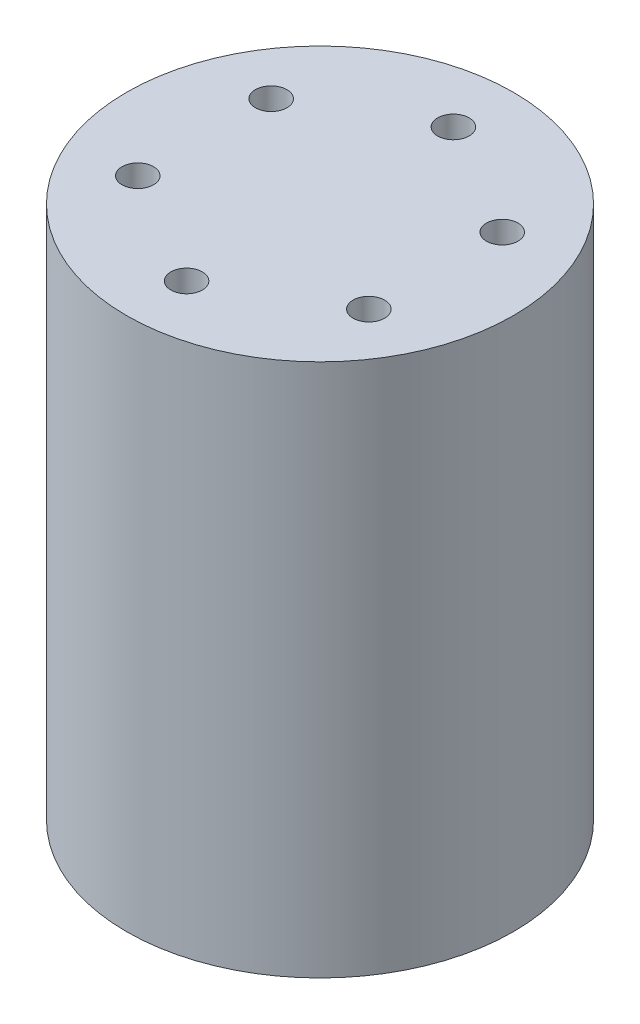
ISO-10303-21;
HEADER;
FILE_DESCRIPTION(('STEP AP214'),'2;1');
FILE_NAME('part.step','',(''),(''),'','','');
FILE_SCHEMA(('AUTOMOTIVE_DESIGN { 1 0 10303 214 1 1 1 1 }'));
ENDSEC;
DATA;
#1=APPLICATION_CONTEXT('core data for automotive mechanical design processes');
#2=APPLICATION_PROTOCOL_DEFINITION('international standard','automotive_design',2000,#1);
#3=PRODUCT_CONTEXT('',#1,'mechanical');
#4=PRODUCT('Part','Part','',(#3));
#5=PRODUCT_RELATED_PRODUCT_CATEGORY('part','',(#4));
#6=PRODUCT_DEFINITION_FORMATION('','',#4);
#7=PRODUCT_DEFINITION_CONTEXT('part definition',#1,'design');
#8=PRODUCT_DEFINITION('design','',#6,#7);
#9=PRODUCT_DEFINITION_SHAPE('','',#8);
#10=(LENGTH_UNIT() NAMED_UNIT(*) SI_UNIT(.MILLI.,.METRE.));
#11=(NAMED_UNIT(*) PLANE_ANGLE_UNIT() SI_UNIT($,.RADIAN.));
#12=(NAMED_UNIT(*) SI_UNIT($,.STERADIAN.) SOLID_ANGLE_UNIT());
#13=UNCERTAINTY_MEASURE_WITH_UNIT(LENGTH_MEASURE(1.E-05),#10,'distance_accuracy_value','');
#14=(GEOMETRIC_REPRESENTATION_CONTEXT(3) GLOBAL_UNCERTAINTY_ASSIGNED_CONTEXT((#13)) GLOBAL_UNIT_ASSIGNED_CONTEXT((#10,
#11,#12)) REPRESENTATION_CONTEXT('',''));
#15=CARTESIAN_POINT('',(0.,0.,0.));
#16=DIRECTION('',(0.,0.,1.));
#17=DIRECTION('',(1.,0.,0.));
#18=AXIS2_PLACEMENT_3D('',#15,#16,#17);
#19=CARTESIAN_POINT('',(0.,25.4,0.));
#20=DIRECTION('',(0.,-1.,0.));
#21=DIRECTION('',(0.,0.,-1.));
#22=AXIS2_PLACEMENT_3D('',#19,#20,#21);
#23=CYLINDRICAL_SURFACE('',#22,18.415);
#24=CARTESIAN_POINT('',(0.,25.4,0.));
#25=DIRECTION('',(0.,1.,0.));
#26=DIRECTION('',(0.,0.,1.));
#27=AXIS2_PLACEMENT_3D('',#24,#25,#26);
#28=CIRCLE('',#27,18.415);
#29=CARTESIAN_POINT('',(0.,25.4,18.415));
#30=VERTEX_POINT('',#29);
#31=EDGE_CURVE('E11',#30,#30,#28,.T.);
#32=ORIENTED_EDGE('',*,*,#31,.F.);
#33=EDGE_LOOP('',(#32));
#34=FACE_BOUND('',#33,.T.);
#35=CARTESIAN_POINT('',(0.,-25.4,0.));
#36=DIRECTION('',(0.,1.,0.));
#37=DIRECTION('',(0.,0.,1.));
#38=AXIS2_PLACEMENT_3D('',#35,#36,#37);
#39=CIRCLE('',#38,18.415);
#40=CARTESIAN_POINT('',(0.,-25.4,18.415));
#41=VERTEX_POINT('',#40);
#42=EDGE_CURVE('E37',#41,#41,#39,.T.);
#43=ORIENTED_EDGE('',*,*,#42,.T.);
#44=EDGE_LOOP('',(#43));
#45=FACE_BOUND('',#44,.T.);
#46=ADVANCED_FACE('F34',(#34,#45),#23,.T.);
#47=CARTESIAN_POINT('',(0.,25.4,0.));
#48=DIRECTION('',(0.,1.,0.));
#49=DIRECTION('',(0.,0.,1.));
#50=AXIS2_PLACEMENT_3D('',#47,#48,#49);
#51=PLANE('',#50);
#52=CARTESIAN_POINT('',(10.9985226280623,25.4,-6.35000000000013));
#53=DIRECTION('',(0.,1.,0.));
#54=DIRECTION('',(-0.866025403784433,0.,0.50000000000001));
#55=AXIS2_PLACEMENT_3D('',#52,#53,#54);
#56=CIRCLE('',#55,1.5);
#57=CARTESIAN_POINT('',(9.69948452238565,25.4,-5.60000000000011));
#58=VERTEX_POINT('',#57);
#59=EDGE_CURVE('E58',#58,#58,#56,.T.);
#60=ORIENTED_EDGE('',*,*,#59,.F.);
#61=EDGE_LOOP('',(#60));
#62=FACE_BOUND('',#61,.T.);
#63=CARTESIAN_POINT('',(10.9985226280624,25.4,6.3499999999999));
#64=DIRECTION('',(0.,1.,0.));
#65=DIRECTION('',(-0.866025403784443,0.,-0.499999999999992));
#66=AXIS2_PLACEMENT_3D('',#63,#64,#65);
#67=CIRCLE('',#66,1.5);
#68=CARTESIAN_POINT('',(9.69948452238576,25.4,5.59999999999991));
#69=VERTEX_POINT('',#68);
#70=EDGE_CURVE('E64',#69,#69,#67,.T.);
#71=ORIENTED_EDGE('',*,*,#70,.F.);
#72=EDGE_LOOP('',(#71));
#73=FACE_BOUND('',#72,.T.);
#74=CARTESIAN_POINT('',(0.,25.4,12.7));
#75=DIRECTION('',(0.,1.,0.));
#76=DIRECTION('',(0.,0.,-1.));
#77=AXIS2_PLACEMENT_3D('',#74,#75,#76);
#78=CIRCLE('',#77,1.5);
#79=CARTESIAN_POINT('',(0.,25.4,11.2));
#80=VERTEX_POINT('',#79);
#81=EDGE_CURVE('E70',#80,#80,#78,.T.);
#82=ORIENTED_EDGE('',*,*,#81,.F.);
#83=EDGE_LOOP('',(#82));
#84=FACE_BOUND('',#83,.T.);
#85=CARTESIAN_POINT('',(-10.9985226280623,25.4,6.35000000000005));
#86=DIRECTION('',(0.,1.,0.));
#87=DIRECTION('',(0.866025403784436,0.,-0.500000000000004));
#88=AXIS2_PLACEMENT_3D('',#85,#86,#87);
#89=CIRCLE('',#88,1.5);
#90=CARTESIAN_POINT('',(-9.69948452238569,25.4,5.60000000000005));
#91=VERTEX_POINT('',#90);
#92=EDGE_CURVE('E76',#91,#91,#89,.T.);
#93=ORIENTED_EDGE('',*,*,#92,.F.);
#94=EDGE_LOOP('',(#93));
#95=FACE_BOUND('',#94,.T.);
#96=CARTESIAN_POINT('',(-10.9985226280624,25.4,-6.34999999999997));
#97=DIRECTION('',(0.,1.,0.));
#98=DIRECTION('',(0.86602540378444,0.,0.499999999999998));
#99=AXIS2_PLACEMENT_3D('',#96,#97,#98);
#100=CIRCLE('',#99,1.5);
#101=CARTESIAN_POINT('',(-9.69948452238573,25.4,-5.59999999999998));
#102=VERTEX_POINT('',#101);
#103=EDGE_CURVE('E52',#102,#102,#100,.T.);
#104=ORIENTED_EDGE('',*,*,#103,.F.);
#105=EDGE_LOOP('',(#104));
#106=FACE_BOUND('',#105,.T.);
#107=CARTESIAN_POINT('',(0.,25.4,-12.7));
#108=DIRECTION('',(0.,1.,0.));
#109=DIRECTION('',(0.,0.,1.));
#110=AXIS2_PLACEMENT_3D('',#107,#108,#109);
#111=CIRCLE('',#110,1.5);
#112=CARTESIAN_POINT('',(0.,25.4,-11.2));
#113=VERTEX_POINT('',#112);
#114=EDGE_CURVE('E46',#113,#113,#111,.T.);
#115=ORIENTED_EDGE('',*,*,#114,.F.);
#116=EDGE_LOOP('',(#115));
#117=FACE_BOUND('',#116,.T.);
#118=ORIENTED_EDGE('',*,*,#31,.T.);
#119=EDGE_LOOP('',(#118));
#120=FACE_BOUND('',#119,.T.);
#121=ADVANCED_FACE('F91',(#62,#73,#84,#95,#106,#117,#120),#51,.T.);
#122=CARTESIAN_POINT('',(0.,-25.4,0.));
#123=DIRECTION('',(0.,1.,0.));
#124=DIRECTION('',(0.,0.,1.));
#125=AXIS2_PLACEMENT_3D('',#122,#123,#124);
#126=PLANE('',#125);
#127=ORIENTED_EDGE('',*,*,#42,.F.);
#128=EDGE_LOOP('',(#127));
#129=FACE_BOUND('',#128,.T.);
#130=ADVANCED_FACE('F94',(#129),#126,.F.);
#131=CARTESIAN_POINT('',(0.,12.7,-12.7));
#132=DIRECTION('',(0.,1.,0.));
#133=DIRECTION('',(0.,0.,1.));
#134=AXIS2_PLACEMENT_3D('',#131,#132,#133);
#135=CYLINDRICAL_SURFACE('',#134,1.5);
#136=CARTESIAN_POINT('',(0.,12.7,-12.7));
#137=DIRECTION('',(0.,1.,0.));
#138=DIRECTION('',(0.,0.,1.));
#139=AXIS2_PLACEMENT_3D('',#136,#137,#138);
#140=CIRCLE('',#139,1.5);
#141=CARTESIAN_POINT('',(0.,12.7,-11.2));
#142=VERTEX_POINT('',#141);
#143=EDGE_CURVE('E44',#142,#142,#140,.T.);
#144=ORIENTED_EDGE('',*,*,#143,.F.);
#145=EDGE_LOOP('',(#144));
#146=FACE_BOUND('',#145,.T.);
#147=ORIENTED_EDGE('',*,*,#114,.T.);
#148=EDGE_LOOP('',(#147));
#149=FACE_BOUND('',#148,.T.);
#150=ADVANCED_FACE('F101',(#146,#149),#135,.F.);
#151=CARTESIAN_POINT('',(0.,12.7,-12.7));
#152=DIRECTION('',(0.,1.,0.));
#153=DIRECTION('',(0.,0.,1.));
#154=AXIS2_PLACEMENT_3D('',#151,#152,#153);
#155=PLANE('',#154);
#156=ORIENTED_EDGE('',*,*,#143,.T.);
#157=EDGE_LOOP('',(#156));
#158=FACE_BOUND('',#157,.T.);
#159=ADVANCED_FACE('F103',(#158),#155,.T.);
#160=CARTESIAN_POINT('',(-10.9985226280624,12.7,-6.34999999999997));
#161=DIRECTION('',(0.,1.,0.));
#162=DIRECTION('',(0.,0.,1.));
#163=AXIS2_PLACEMENT_3D('',#160,#161,#162);
#164=CYLINDRICAL_SURFACE('',#163,1.5);
#165=CARTESIAN_POINT('',(-10.9985226280624,12.7,-6.34999999999997));
#166=DIRECTION('',(0.,1.,0.));
#167=DIRECTION('',(0.86602540378444,0.,0.499999999999998));
#168=AXIS2_PLACEMENT_3D('',#165,#166,#167);
#169=CIRCLE('',#168,1.5);
#170=CARTESIAN_POINT('',(-9.69948452238573,12.7,-5.59999999999998));
#171=VERTEX_POINT('',#170);
#172=EDGE_CURVE('E49',#171,#171,#169,.T.);
#173=ORIENTED_EDGE('',*,*,#172,.F.);
#174=EDGE_LOOP('',(#173));
#175=FACE_BOUND('',#174,.T.);
#176=ORIENTED_EDGE('',*,*,#103,.T.);
#177=EDGE_LOOP('',(#176));
#178=FACE_BOUND('',#177,.T.);
#179=ADVANCED_FACE('F110',(#175,#178),#164,.F.);
#180=CARTESIAN_POINT('',(-10.9985226280624,12.7,-6.34999999999997));
#181=DIRECTION('',(0.,1.,0.));
#182=DIRECTION('',(0.86602540378444,0.,0.499999999999998));
#183=AXIS2_PLACEMENT_3D('',#180,#181,#182);
#184=PLANE('',#183);
#185=ORIENTED_EDGE('',*,*,#172,.T.);
#186=EDGE_LOOP('',(#185));
#187=FACE_BOUND('',#186,.T.);
#188=ADVANCED_FACE('F87',(#187),#184,.T.);
#189=CARTESIAN_POINT('',(-10.9985226280623,12.7,6.35000000000005));
#190=DIRECTION('',(0.,1.,0.));
#191=DIRECTION('',(0.,0.,1.));
#192=AXIS2_PLACEMENT_3D('',#189,#190,#191);
#193=CYLINDRICAL_SURFACE('',#192,1.5);
#194=CARTESIAN_POINT('',(-10.9985226280623,12.7,6.35000000000005));
#195=DIRECTION('',(0.,1.,0.));
#196=DIRECTION('',(0.866025403784436,0.,-0.500000000000004));
#197=AXIS2_PLACEMENT_3D('',#194,#195,#196);
#198=CIRCLE('',#197,1.5);
#199=CARTESIAN_POINT('',(-9.69948452238569,12.7,5.60000000000005));
#200=VERTEX_POINT('',#199);
#201=EDGE_CURVE('E55',#200,#200,#198,.T.);
#202=ORIENTED_EDGE('',*,*,#201,.F.);
#203=EDGE_LOOP('',(#202));
#204=FACE_BOUND('',#203,.T.);
#205=ORIENTED_EDGE('',*,*,#92,.T.);
#206=EDGE_LOOP('',(#205));
#207=FACE_BOUND('',#206,.T.);
#208=ADVANCED_FACE('F84',(#204,#207),#193,.F.);
#209=CARTESIAN_POINT('',(-10.9985226280623,12.7,6.35000000000005));
#210=DIRECTION('',(0.,1.,0.));
#211=DIRECTION('',(0.866025403784436,0.,-0.500000000000004));
#212=AXIS2_PLACEMENT_3D('',#209,#210,#211);
#213=PLANE('',#212);
#214=ORIENTED_EDGE('',*,*,#201,.T.);
#215=EDGE_LOOP('',(#214));
#216=FACE_BOUND('',#215,.T.);
#217=ADVANCED_FACE('F82',(#216),#213,.T.);
#218=CARTESIAN_POINT('',(0.,12.7,12.7));
#219=DIRECTION('',(0.,1.,0.));
#220=DIRECTION('',(0.,0.,1.));
#221=AXIS2_PLACEMENT_3D('',#218,#219,#220);
#222=CYLINDRICAL_SURFACE('',#221,1.5);
#223=CARTESIAN_POINT('',(0.,12.7,12.7));
#224=DIRECTION('',(0.,1.,0.));
#225=DIRECTION('',(0.,0.,-1.));
#226=AXIS2_PLACEMENT_3D('',#223,#224,#225);
#227=CIRCLE('',#226,1.5);
#228=CARTESIAN_POINT('',(0.,12.7,11.2));
#229=VERTEX_POINT('',#228);
#230=EDGE_CURVE('E73',#229,#229,#227,.T.);
#231=ORIENTED_EDGE('',*,*,#230,.F.);
#232=EDGE_LOOP('',(#231));
#233=FACE_BOUND('',#232,.T.);
#234=ORIENTED_EDGE('',*,*,#81,.T.);
#235=EDGE_LOOP('',(#234));
#236=FACE_BOUND('',#235,.T.);
#237=ADVANCED_FACE('F165',(#233,#236),#222,.F.);
#238=CARTESIAN_POINT('',(0.,12.7,12.7));
#239=DIRECTION('',(0.,1.,0.));
#240=DIRECTION('',(0.,0.,-1.));
#241=AXIS2_PLACEMENT_3D('',#238,#239,#240);
#242=PLANE('',#241);
#243=ORIENTED_EDGE('',*,*,#230,.T.);
#244=EDGE_LOOP('',(#243));
#245=FACE_BOUND('',#244,.T.);
#246=ADVANCED_FACE('F172',(#245),#242,.T.);
#247=CARTESIAN_POINT('',(10.9985226280624,12.7,6.3499999999999));
#248=DIRECTION('',(0.,1.,0.));
#249=DIRECTION('',(0.,0.,1.));
#250=AXIS2_PLACEMENT_3D('',#247,#248,#249);
#251=CYLINDRICAL_SURFACE('',#250,1.5);
#252=CARTESIAN_POINT('',(10.9985226280624,12.7,6.3499999999999));
#253=DIRECTION('',(0.,1.,0.));
#254=DIRECTION('',(-0.866025403784443,0.,-0.499999999999992));
#255=AXIS2_PLACEMENT_3D('',#252,#253,#254);
#256=CIRCLE('',#255,1.5);
#257=CARTESIAN_POINT('',(9.69948452238576,12.7,5.59999999999991));
#258=VERTEX_POINT('',#257);
#259=EDGE_CURVE('E67',#258,#258,#256,.T.);
#260=ORIENTED_EDGE('',*,*,#259,.F.);
#261=EDGE_LOOP('',(#260));
#262=FACE_BOUND('',#261,.T.);
#263=ORIENTED_EDGE('',*,*,#70,.T.);
#264=EDGE_LOOP('',(#263));
#265=FACE_BOUND('',#264,.T.);
#266=ADVANCED_FACE('F180',(#262,#265),#251,.F.);
#267=CARTESIAN_POINT('',(10.9985226280624,12.7,6.3499999999999));
#268=DIRECTION('',(0.,1.,0.));
#269=DIRECTION('',(-0.866025403784443,0.,-0.499999999999992));
#270=AXIS2_PLACEMENT_3D('',#267,#268,#269);
#271=PLANE('',#270);
#272=ORIENTED_EDGE('',*,*,#259,.T.);
#273=EDGE_LOOP('',(#272));
#274=FACE_BOUND('',#273,.T.);
#275=ADVANCED_FACE('F188',(#274),#271,.T.);
#276=CARTESIAN_POINT('',(10.9985226280623,12.7,-6.35000000000013));
#277=DIRECTION('',(0.,1.,0.));
#278=DIRECTION('',(0.,0.,1.));
#279=AXIS2_PLACEMENT_3D('',#276,#277,#278);
#280=CYLINDRICAL_SURFACE('',#279,1.5);
#281=CARTESIAN_POINT('',(10.9985226280623,12.7,-6.35000000000013));
#282=DIRECTION('',(0.,1.,0.));
#283=DIRECTION('',(-0.866025403784433,0.,0.50000000000001));
#284=AXIS2_PLACEMENT_3D('',#281,#282,#283);
#285=CIRCLE('',#284,1.5);
#286=CARTESIAN_POINT('',(9.69948452238565,12.7,-5.60000000000011));
#287=VERTEX_POINT('',#286);
#288=EDGE_CURVE('E61',#287,#287,#285,.T.);
#289=ORIENTED_EDGE('',*,*,#288,.F.);
#290=EDGE_LOOP('',(#289));
#291=FACE_BOUND('',#290,.T.);
#292=ORIENTED_EDGE('',*,*,#59,.T.);
#293=EDGE_LOOP('',(#292));
#294=FACE_BOUND('',#293,.T.);
#295=ADVANCED_FACE('F196',(#291,#294),#280,.F.);
#296=CARTESIAN_POINT('',(10.9985226280623,12.7,-6.35000000000013));
#297=DIRECTION('',(0.,1.,0.));
#298=DIRECTION('',(-0.866025403784433,0.,0.50000000000001));
#299=AXIS2_PLACEMENT_3D('',#296,#297,#298);
#300=PLANE('',#299);
#301=ORIENTED_EDGE('',*,*,#288,.T.);
#302=EDGE_LOOP('',(#301));
#303=FACE_BOUND('',#302,.T.);
#304=ADVANCED_FACE('F204',(#303),#300,.T.);
#305=CLOSED_SHELL('',(#46,#121,#130,#150,#159,#179,#188,#208,#217,#237,#246,#266,#275,#295,#304));
#306=MANIFOLD_SOLID_BREP('B2',#305);
#307=ADVANCED_BREP_SHAPE_REPRESENTATION('',(#18,#306),#14);
#308=SHAPE_DEFINITION_REPRESENTATION(#9,#307);
ENDSEC;
END-ISO-10303-21;
